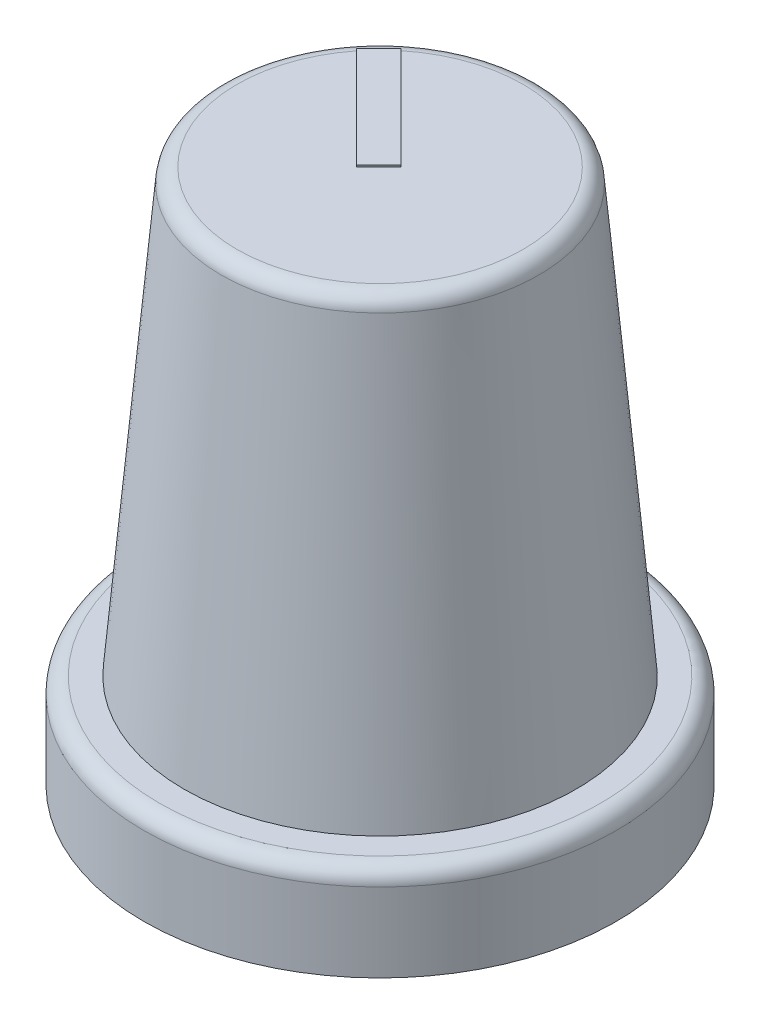
ISO-10303-21;
HEADER;
FILE_DESCRIPTION(('STEP AP214'),'2;1');
FILE_NAME('part.step','',(''),(''),'','','');
FILE_SCHEMA(('AUTOMOTIVE_DESIGN { 1 0 10303 214 1 1 1 1 }'));
ENDSEC;
DATA;
#1=APPLICATION_CONTEXT('core data for automotive mechanical design processes');
#2=APPLICATION_PROTOCOL_DEFINITION('international standard','automotive_design',2000,#1);
#3=PRODUCT_CONTEXT('',#1,'mechanical');
#4=PRODUCT('Part','Part','',(#3));
#5=PRODUCT_RELATED_PRODUCT_CATEGORY('part','',(#4));
#6=PRODUCT_DEFINITION_FORMATION('','',#4);
#7=PRODUCT_DEFINITION_CONTEXT('part definition',#1,'design');
#8=PRODUCT_DEFINITION('design','',#6,#7);
#9=PRODUCT_DEFINITION_SHAPE('','',#8);
#10=(LENGTH_UNIT() NAMED_UNIT(*) SI_UNIT(.MILLI.,.METRE.));
#11=(NAMED_UNIT(*) PLANE_ANGLE_UNIT() SI_UNIT($,.RADIAN.));
#12=(NAMED_UNIT(*) SI_UNIT($,.STERADIAN.) SOLID_ANGLE_UNIT());
#13=UNCERTAINTY_MEASURE_WITH_UNIT(LENGTH_MEASURE(1.E-05),#10,'distance_accuracy_value','');
#14=(GEOMETRIC_REPRESENTATION_CONTEXT(3) GLOBAL_UNCERTAINTY_ASSIGNED_CONTEXT((#13)) GLOBAL_UNIT_ASSIGNED_CONTEXT((#10,
#11,#12)) REPRESENTATION_CONTEXT('',''));
#15=CARTESIAN_POINT('',(0.,0.,0.));
#16=DIRECTION('',(0.,0.,1.));
#17=DIRECTION('',(1.,0.,0.));
#18=AXIS2_PLACEMENT_3D('',#15,#16,#17);
#19=CARTESIAN_POINT('',(0.,17.,0.));
#20=DIRECTION('',(0.,1.,0.));
#21=DIRECTION('',(0.,0.,1.));
#22=AXIS2_PLACEMENT_3D('',#19,#20,#21);
#23=PLANE('',#22);
#24=DIRECTION('',(0.707106781186547,0.,-0.707106781186547));
#25=VECTOR('',#24,1.);
#26=CARTESIAN_POINT('',(-0.372418319442191,17.,0.372418319442192));
#27=LINE('',#26,#25);
#28=CARTESIAN_POINT('',(-0.372418319442191,17.,0.372418319442192));
#29=VERTEX_POINT('',#28);
#30=CARTESIAN_POINT('',(0.334688461744356,17.,-0.334688461744356));
#31=VERTEX_POINT('',#30);
#32=EDGE_CURVE('E54',#29,#31,#27,.T.);
#33=ORIENTED_EDGE('',*,*,#32,.F.);
#34=DIRECTION('',(0.707106781186548,0.,0.707106781186548));
#35=VECTOR('',#34,1.);
#36=CARTESIAN_POINT('',(-3.58392482449173,17.,-2.83908818560734));
#37=LINE('',#36,#35);
#38=CARTESIAN_POINT('',(-3.56231400940759,17.,-2.81747737052321));
#39=VERTEX_POINT('',#38);
#40=EDGE_CURVE('E89',#39,#29,#37,.T.);
#41=ORIENTED_EDGE('',*,*,#40,.F.);
#42=CARTESIAN_POINT('',(0.,17.,0.));
#43=DIRECTION('',(0.,1.,0.));
#44=DIRECTION('',(0.,0.,1.));
#45=AXIS2_PLACEMENT_3D('',#42,#43,#44);
#46=CIRCLE('',#45,4.54183441299129);
#47=CARTESIAN_POINT('',(-2.85938629490915,17.,-3.52876321839786));
#48=VERTEX_POINT('',#47);
#49=EDGE_CURVE('E94',#39,#48,#46,.T.);
#50=ORIENTED_EDGE('',*,*,#49,.T.);
#51=DIRECTION('',(-0.707106781186548,0.,-0.707106781186548));
#52=VECTOR('',#51,1.);
#53=CARTESIAN_POINT('',(0.334688461744356,17.,-0.334688461744356));
#54=LINE('',#53,#52);
#55=EDGE_CURVE('E104',#31,#48,#54,.T.);
#56=ORIENTED_EDGE('',*,*,#55,.F.);
#57=EDGE_LOOP('',(#33,#41,#50,#56));
#58=FACE_BOUND('',#57,.T.);
#59=ADVANCED_FACE('F36',(#58),#23,.T.);
#60=CARTESIAN_POINT('',(0.,3.,0.));
#61=DIRECTION('',(0.,-1.,0.));
#62=DIRECTION('',(0.,0.,-1.));
#63=AXIS2_PLACEMENT_3D('',#60,#61,#62);
#64=CYLINDRICAL_SURFACE('',#63,7.5);
#65=CARTESIAN_POINT('',(0.,2.5,0.));
#66=DIRECTION('',(0.,1.,0.));
#67=DIRECTION('',(0.,0.,1.));
#68=AXIS2_PLACEMENT_3D('',#65,#66,#67);
#69=CIRCLE('',#68,7.5);
#70=CARTESIAN_POINT('',(0.,2.5,7.5));
#71=VERTEX_POINT('',#70);
#72=EDGE_CURVE('E148',#71,#71,#69,.F.);
#73=ORIENTED_EDGE('',*,*,#72,.T.);
#74=EDGE_LOOP('',(#73));
#75=FACE_BOUND('',#74,.T.);
#76=CARTESIAN_POINT('',(0.,0.,0.));
#77=DIRECTION('',(0.,1.,0.));
#78=DIRECTION('',(0.,0.,1.));
#79=AXIS2_PLACEMENT_3D('',#76,#77,#78);
#80=CIRCLE('',#79,7.5);
#81=CARTESIAN_POINT('',(0.,0.,7.5));
#82=VERTEX_POINT('',#81);
#83=EDGE_CURVE('E142',#82,#82,#80,.T.);
#84=ORIENTED_EDGE('',*,*,#83,.T.);
#85=EDGE_LOOP('',(#84));
#86=FACE_BOUND('',#85,.T.);
#87=ADVANCED_FACE('F185',(#75,#86),#64,.T.);
#88=CARTESIAN_POINT('',(0.,3.,0.));
#89=DIRECTION('',(0.,1.,0.));
#90=DIRECTION('',(0.,0.,1.));
#91=AXIS2_PLACEMENT_3D('',#88,#89,#90);
#92=PLANE('',#91);
#93=CARTESIAN_POINT('',(0.,3.,0.));
#94=DIRECTION('',(0.,1.,0.));
#95=DIRECTION('',(0.,0.,1.));
#96=AXIS2_PLACEMENT_3D('',#93,#94,#95);
#97=CIRCLE('',#96,7.);
#98=CARTESIAN_POINT('',(0.,3.,7.));
#99=VERTEX_POINT('',#98);
#100=EDGE_CURVE('E145',#99,#99,#97,.T.);
#101=ORIENTED_EDGE('',*,*,#100,.T.);
#102=EDGE_LOOP('',(#101));
#103=FACE_BOUND('',#102,.T.);
#104=CARTESIAN_POINT('',(0.,3.,0.));
#105=DIRECTION('',(0.,1.,0.));
#106=DIRECTION('',(0.,0.,1.));
#107=AXIS2_PLACEMENT_3D('',#104,#105,#106);
#108=CIRCLE('',#107,6.22484128936294);
#109=CARTESIAN_POINT('',(0.,3.,6.22484128936294));
#110=VERTEX_POINT('',#109);
#111=EDGE_CURVE('E139',#110,#110,#108,.F.);
#112=ORIENTED_EDGE('',*,*,#111,.T.);
#113=EDGE_LOOP('',(#112));
#114=FACE_BOUND('',#113,.T.);
#115=ADVANCED_FACE('F190',(#103,#114),#92,.T.);
#116=CARTESIAN_POINT('',(0.,0.,0.));
#117=DIRECTION('',(0.,1.,0.));
#118=DIRECTION('',(0.,0.,1.));
#119=AXIS2_PLACEMENT_3D('',#116,#117,#118);
#120=PLANE('',#119);
#121=CARTESIAN_POINT('',(0.,0.,0.));
#122=DIRECTION('',(0.,-1.,0.));
#123=DIRECTION('',(0.,0.,-1.));
#124=AXIS2_PLACEMENT_3D('',#121,#122,#123);
#125=CIRCLE('',#124,6.5);
#126=CARTESIAN_POINT('',(0.,0.,-6.5));
#127=VERTEX_POINT('',#126);
#128=EDGE_CURVE('E133',#127,#127,#125,.T.);
#129=ORIENTED_EDGE('',*,*,#128,.F.);
#130=EDGE_LOOP('',(#129));
#131=FACE_BOUND('',#130,.T.);
#132=ORIENTED_EDGE('',*,*,#83,.F.);
#133=EDGE_LOOP('',(#132));
#134=FACE_BOUND('',#133,.T.);
#135=ADVANCED_FACE('F200',(#131,#134),#120,.F.);
#136=CARTESIAN_POINT('',(0.,17.,0.));
#137=DIRECTION('',(0.,-1.,0.));
#138=DIRECTION('',(0.,0.,1.));
#139=AXIS2_PLACEMENT_3D('',#136,#137,#138);
#140=CONICAL_SURFACE('',#139,5.,0.0872664625997165);
#141=CARTESIAN_POINT('',(0.,16.5435778713738,0.));
#142=DIRECTION('',(0.,1.,0.));
#143=DIRECTION('',(0.,0.,1.));
#144=AXIS2_PLACEMENT_3D('',#141,#142,#143);
#145=CIRCLE('',#144,5.03993176203716);
#146=CARTESIAN_POINT('',(0.,16.5435778713738,5.03993176203716));
#147=VERTEX_POINT('',#146);
#148=EDGE_CURVE('E12',#147,#147,#145,.F.);
#149=ORIENTED_EDGE('',*,*,#148,.T.);
#150=EDGE_LOOP('',(#149));
#151=FACE_BOUND('',#150,.T.);
#152=ORIENTED_EDGE('',*,*,#111,.F.);
#153=EDGE_LOOP('',(#152));
#154=FACE_BOUND('',#153,.T.);
#155=ADVANCED_FACE('F197',(#151,#154),#140,.T.);
#156=CARTESIAN_POINT('',(0.,2.,0.));
#157=DIRECTION('',(0.,1.,0.));
#158=DIRECTION('',(0.,0.,1.));
#159=AXIS2_PLACEMENT_3D('',#156,#157,#158);
#160=PLANE('',#159);
#161=CARTESIAN_POINT('',(0.,2.,0.));
#162=DIRECTION('',(0.,-1.,0.));
#163=DIRECTION('',(0.,0.,-1.));
#164=AXIS2_PLACEMENT_3D('',#161,#162,#163);
#165=CIRCLE('',#164,5.5);
#166=CARTESIAN_POINT('',(0.,2.,-5.5));
#167=VERTEX_POINT('',#166);
#168=EDGE_CURVE('E127',#167,#167,#165,.T.);
#169=ORIENTED_EDGE('',*,*,#168,.F.);
#170=EDGE_LOOP('',(#169));
#171=FACE_BOUND('',#170,.T.);
#172=CARTESIAN_POINT('',(0.,2.,0.));
#173=DIRECTION('',(0.,1.,0.));
#174=DIRECTION('',(0.,0.,1.));
#175=AXIS2_PLACEMENT_3D('',#172,#173,#174);
#176=CIRCLE('',#175,6.5);
#177=CARTESIAN_POINT('',(0.,2.,6.5));
#178=VERTEX_POINT('',#177);
#179=EDGE_CURVE('E136',#178,#178,#176,.F.);
#180=ORIENTED_EDGE('',*,*,#179,.T.);
#181=EDGE_LOOP('',(#180));
#182=FACE_BOUND('',#181,.T.);
#183=ADVANCED_FACE('F195',(#171,#182),#160,.F.);
#184=CARTESIAN_POINT('',(0.,21.3847763108502,0.));
#185=DIRECTION('',(0.,-1.,0.));
#186=DIRECTION('',(0.,0.,-1.));
#187=AXIS2_PLACEMENT_3D('',#184,#185,#186);
#188=CYLINDRICAL_SURFACE('',#187,6.5);
#189=ORIENTED_EDGE('',*,*,#128,.T.);
#190=EDGE_LOOP('',(#189));
#191=FACE_BOUND('',#190,.T.);
#192=ORIENTED_EDGE('',*,*,#179,.F.);
#193=EDGE_LOOP('',(#192));
#194=FACE_BOUND('',#193,.T.);
#195=ADVANCED_FACE('F230',(#191,#194),#188,.F.);
#196=CARTESIAN_POINT('',(0.,16.,0.));
#197=DIRECTION('',(0.,1.,0.));
#198=DIRECTION('',(0.,0.,1.));
#199=AXIS2_PLACEMENT_3D('',#196,#197,#198);
#200=PLANE('',#199);
#201=CARTESIAN_POINT('',(0.,16.,0.));
#202=DIRECTION('',(0.,1.,0.));
#203=DIRECTION('',(0.,0.,1.));
#204=AXIS2_PLACEMENT_3D('',#201,#202,#203);
#205=CIRCLE('',#204,4.27515871063706);
#206=CARTESIAN_POINT('',(0.,16.,4.27515871063706));
#207=VERTEX_POINT('',#206);
#208=EDGE_CURVE('E130',#207,#207,#205,.F.);
#209=ORIENTED_EDGE('',*,*,#208,.T.);
#210=EDGE_LOOP('',(#209));
#211=FACE_BOUND('',#210,.T.);
#212=ADVANCED_FACE('F216',(#211),#200,.F.);
#213=CARTESIAN_POINT('',(0.,2.,0.));
#214=DIRECTION('',(0.,-1.,0.));
#215=DIRECTION('',(0.,0.,-1.));
#216=AXIS2_PLACEMENT_3D('',#213,#214,#215);
#217=CONICAL_SURFACE('',#216,5.5,0.0872664625997165);
#218=ORIENTED_EDGE('',*,*,#168,.T.);
#219=EDGE_LOOP('',(#218));
#220=FACE_BOUND('',#219,.T.);
#221=ORIENTED_EDGE('',*,*,#208,.F.);
#222=EDGE_LOOP('',(#221));
#223=FACE_BOUND('',#222,.T.);
#224=ADVANCED_FACE('F209',(#220,#223),#217,.F.);
#225=CARTESIAN_POINT('',(0.,2.5,0.));
#226=DIRECTION('',(0.,1.,0.));
#227=DIRECTION('',(0.,0.,1.));
#228=AXIS2_PLACEMENT_3D('',#225,#226,#227);
#229=TOROIDAL_SURFACE('',#228,7.,0.5);
#230=ORIENTED_EDGE('',*,*,#72,.F.);
#231=EDGE_LOOP('',(#230));
#232=FACE_BOUND('',#231,.T.);
#233=ORIENTED_EDGE('',*,*,#100,.F.);
#234=EDGE_LOOP('',(#233));
#235=FACE_BOUND('',#234,.T.);
#236=ADVANCED_FACE('F207',(#232,#235),#229,.T.);
#237=CARTESIAN_POINT('',(0.,16.5,0.));
#238=DIRECTION('',(0.,1.,0.));
#239=DIRECTION('',(0.,0.,1.));
#240=AXIS2_PLACEMENT_3D('',#237,#238,#239);
#241=TOROIDAL_SURFACE('',#240,4.54183441299129,0.5);
#242=ORIENTED_EDGE('',*,*,#148,.F.);
#243=EDGE_LOOP('',(#242));
#244=FACE_BOUND('',#243,.T.);
#245=CARTESIAN_POINT('',(-3.19264157620069,17.,-3.23037143389839));
#246=VERTEX_POINT('',#245);
#247=EDGE_CURVE('E46',#48,#246,#46,.T.);
#248=ORIENTED_EDGE('',*,*,#247,.F.);
#249=ORIENTED_EDGE('',*,*,#49,.F.);
#250=CARTESIAN_POINT('',(-3.23037143389839,17.,-3.19264157620069));
#251=VERTEX_POINT('',#250);
#252=EDGE_CURVE('E92',#251,#39,#46,.T.);
#253=ORIENTED_EDGE('',*,*,#252,.F.);
#254=DIRECTION('',(0.707106781186548,0.,-0.707106781186548));
#255=VECTOR('',#254,1.);
#256=CARTESIAN_POINT('',(-2.87681804330518,17.,-3.54619496679389));
#257=LINE('',#256,#255);
#258=EDGE_CURVE('E40',#246,#251,#257,.F.);
#259=ORIENTED_EDGE('',*,*,#258,.F.);
#260=EDGE_LOOP('',(#248,#249,#253,#259));
#261=FACE_BOUND('',#260,.T.);
#262=ADVANCED_FACE('F38',(#244,#261),#241,.T.);
#263=CARTESIAN_POINT('',(0.,17.,0.));
#264=DIRECTION('',(0.,1.,0.));
#265=DIRECTION('',(0.,0.,1.));
#266=AXIS2_PLACEMENT_3D('',#263,#264,#265);
#267=PLANE('',#266);
#268=ORIENTED_EDGE('',*,*,#252,.T.);
#269=CARTESIAN_POINT('',(-3.58392482449173,17.,-2.83908818560734));
#270=VERTEX_POINT('',#269);
#271=EDGE_CURVE('E101',#270,#39,#37,.T.);
#272=ORIENTED_EDGE('',*,*,#271,.F.);
#273=DIRECTION('',(-0.707106781186548,0.,0.707106781186548));
#274=VECTOR('',#273,1.);
#275=CARTESIAN_POINT('',(-2.87681804330518,17.,-3.54619496679389));
#276=LINE('',#275,#274);
#277=EDGE_CURVE('E99',#251,#270,#276,.T.);
#278=ORIENTED_EDGE('',*,*,#277,.F.);
#279=EDGE_LOOP('',(#268,#272,#278));
#280=FACE_BOUND('',#279,.T.);
#281=ADVANCED_FACE('F100',(#280),#267,.F.);
#282=CARTESIAN_POINT('',(-3.58392482449173,17.05,-2.83908818560734));
#283=DIRECTION('',(0.707106781186548,0.,-0.707106781186548));
#284=DIRECTION('',(-0.707106781186548,0.,-0.707106781186547));
#285=AXIS2_PLACEMENT_3D('',#282,#283,#284);
#286=PLANE('',#285);
#287=ORIENTED_EDGE('',*,*,#271,.T.);
#288=ORIENTED_EDGE('',*,*,#40,.T.);
#289=DIRECTION('',(0.,-1.,0.));
#290=VECTOR('',#289,1.);
#291=CARTESIAN_POINT('',(-0.372418319442191,17.05,0.372418319442192));
#292=LINE('',#291,#290);
#293=CARTESIAN_POINT('',(-0.372418319442191,17.05,0.372418319442192));
#294=VERTEX_POINT('',#293);
#295=EDGE_CURVE('E124',#294,#29,#292,.T.);
#296=ORIENTED_EDGE('',*,*,#295,.F.);
#297=DIRECTION('',(0.707106781186548,0.,0.707106781186548));
#298=VECTOR('',#297,1.);
#299=CARTESIAN_POINT('',(-3.58392482449173,17.05,-2.83908818560734));
#300=LINE('',#299,#298);
#301=CARTESIAN_POINT('',(-3.58392482449173,17.05,-2.83908818560734));
#302=VERTEX_POINT('',#301);
#303=EDGE_CURVE('E111',#302,#294,#300,.T.);
#304=ORIENTED_EDGE('',*,*,#303,.F.);
#305=DIRECTION('',(0.,-1.,0.));
#306=VECTOR('',#305,1.);
#307=CARTESIAN_POINT('',(-3.58392482449173,17.05,-2.83908818560734));
#308=LINE('',#307,#306);
#309=EDGE_CURVE('E117',#302,#270,#308,.T.);
#310=ORIENTED_EDGE('',*,*,#309,.T.);
#311=EDGE_LOOP('',(#287,#288,#296,#304,#310));
#312=FACE_BOUND('',#311,.T.);
#313=ADVANCED_FACE('F174',(#312),#286,.F.);
#314=CARTESIAN_POINT('',(-0.372418319442191,17.05,0.372418319442192));
#315=DIRECTION('',(-0.707106781186548,0.,-0.707106781186548));
#316=DIRECTION('',(-0.707106781186548,0.,0.707106781186548));
#317=AXIS2_PLACEMENT_3D('',#314,#315,#316);
#318=PLANE('',#317);
#319=ORIENTED_EDGE('',*,*,#32,.T.);
#320=DIRECTION('',(0.,-1.,0.));
#321=VECTOR('',#320,1.);
#322=CARTESIAN_POINT('',(0.334688461744356,17.05,-0.334688461744356));
#323=LINE('',#322,#321);
#324=CARTESIAN_POINT('',(0.334688461744356,17.05,-0.334688461744356));
#325=VERTEX_POINT('',#324);
#326=EDGE_CURVE('E121',#325,#31,#323,.T.);
#327=ORIENTED_EDGE('',*,*,#326,.F.);
#328=DIRECTION('',(0.707106781186547,0.,-0.707106781186547));
#329=VECTOR('',#328,1.);
#330=CARTESIAN_POINT('',(-0.372418319442191,17.05,0.372418319442192));
#331=LINE('',#330,#329);
#332=EDGE_CURVE('E112',#294,#325,#331,.T.);
#333=ORIENTED_EDGE('',*,*,#332,.F.);
#334=ORIENTED_EDGE('',*,*,#295,.T.);
#335=EDGE_LOOP('',(#319,#327,#333,#334));
#336=FACE_BOUND('',#335,.T.);
#337=ADVANCED_FACE('F161',(#336),#318,.F.);
#338=CARTESIAN_POINT('',(0.334688461744356,17.05,-0.334688461744356));
#339=DIRECTION('',(-0.707106781186548,0.,0.707106781186548));
#340=DIRECTION('',(0.707106781186547,0.,0.707106781186548));
#341=AXIS2_PLACEMENT_3D('',#338,#339,#340);
#342=PLANE('',#341);
#343=ORIENTED_EDGE('',*,*,#55,.T.);
#344=CARTESIAN_POINT('',(-2.87681804330518,17.,-3.54619496679389));
#345=VERTEX_POINT('',#344);
#346=EDGE_CURVE('E153',#48,#345,#54,.T.);
#347=ORIENTED_EDGE('',*,*,#346,.T.);
#348=DIRECTION('',(0.,-1.,0.));
#349=VECTOR('',#348,1.);
#350=CARTESIAN_POINT('',(-2.87681804330518,17.05,-3.54619496679389));
#351=LINE('',#350,#349);
#352=CARTESIAN_POINT('',(-2.87681804330518,17.05,-3.54619496679389));
#353=VERTEX_POINT('',#352);
#354=EDGE_CURVE('E119',#353,#345,#351,.T.);
#355=ORIENTED_EDGE('',*,*,#354,.F.);
#356=DIRECTION('',(-0.707106781186548,0.,-0.707106781186548));
#357=VECTOR('',#356,1.);
#358=CARTESIAN_POINT('',(0.334688461744356,17.05,-0.334688461744356));
#359=LINE('',#358,#357);
#360=EDGE_CURVE('E167',#325,#353,#359,.T.);
#361=ORIENTED_EDGE('',*,*,#360,.F.);
#362=ORIENTED_EDGE('',*,*,#326,.T.);
#363=EDGE_LOOP('',(#343,#347,#355,#361,#362));
#364=FACE_BOUND('',#363,.T.);
#365=ADVANCED_FACE('F157',(#364),#342,.F.);
#366=CARTESIAN_POINT('',(-2.87681804330518,17.05,-3.54619496679389));
#367=DIRECTION('',(0.707106781186548,0.,0.707106781186548));
#368=DIRECTION('',(0.707106781186548,0.,-0.707106781186548));
#369=AXIS2_PLACEMENT_3D('',#366,#367,#368);
#370=PLANE('',#369);
#371=EDGE_CURVE('E106',#345,#246,#276,.T.);
#372=ORIENTED_EDGE('',*,*,#371,.T.);
#373=ORIENTED_EDGE('',*,*,#258,.T.);
#374=ORIENTED_EDGE('',*,*,#277,.T.);
#375=ORIENTED_EDGE('',*,*,#309,.F.);
#376=DIRECTION('',(-0.707106781186548,0.,0.707106781186548));
#377=VECTOR('',#376,1.);
#378=CARTESIAN_POINT('',(-2.87681804330518,17.05,-3.54619496679389));
#379=LINE('',#378,#377);
#380=EDGE_CURVE('E77',#353,#302,#379,.T.);
#381=ORIENTED_EDGE('',*,*,#380,.F.);
#382=ORIENTED_EDGE('',*,*,#354,.T.);
#383=EDGE_LOOP('',(#372,#373,#374,#375,#381,#382));
#384=FACE_BOUND('',#383,.T.);
#385=ADVANCED_FACE('F108',(#384),#370,.F.);
#386=CARTESIAN_POINT('',(0.,17.05,0.));
#387=DIRECTION('',(0.,1.,0.));
#388=DIRECTION('',(0.,0.,1.));
#389=AXIS2_PLACEMENT_3D('',#386,#387,#388);
#390=PLANE('',#389);
#391=ORIENTED_EDGE('',*,*,#303,.T.);
#392=ORIENTED_EDGE('',*,*,#332,.T.);
#393=ORIENTED_EDGE('',*,*,#360,.T.);
#394=ORIENTED_EDGE('',*,*,#380,.T.);
#395=EDGE_LOOP('',(#391,#392,#393,#394));
#396=FACE_BOUND('',#395,.T.);
#397=ADVANCED_FACE('F170',(#396),#390,.T.);
#398=ORIENTED_EDGE('',*,*,#247,.T.);
#399=ORIENTED_EDGE('',*,*,#371,.F.);
#400=ORIENTED_EDGE('',*,*,#346,.F.);
#401=EDGE_LOOP('',(#398,#399,#400));
#402=FACE_BOUND('',#401,.T.);
#403=ADVANCED_FACE('F152',(#402),#267,.F.);
#404=CLOSED_SHELL('',(#59,#87,#115,#135,#155,#183,#195,#212,#224,#236,#262,#281,#313,#337,#365,
#385,#397,#403));
#405=MANIFOLD_SOLID_BREP('B2',#404);
#406=ADVANCED_BREP_SHAPE_REPRESENTATION('',(#18,#405),#14);
#407=SHAPE_DEFINITION_REPRESENTATION(#9,#406);
ENDSEC;
END-ISO-10303-21;
